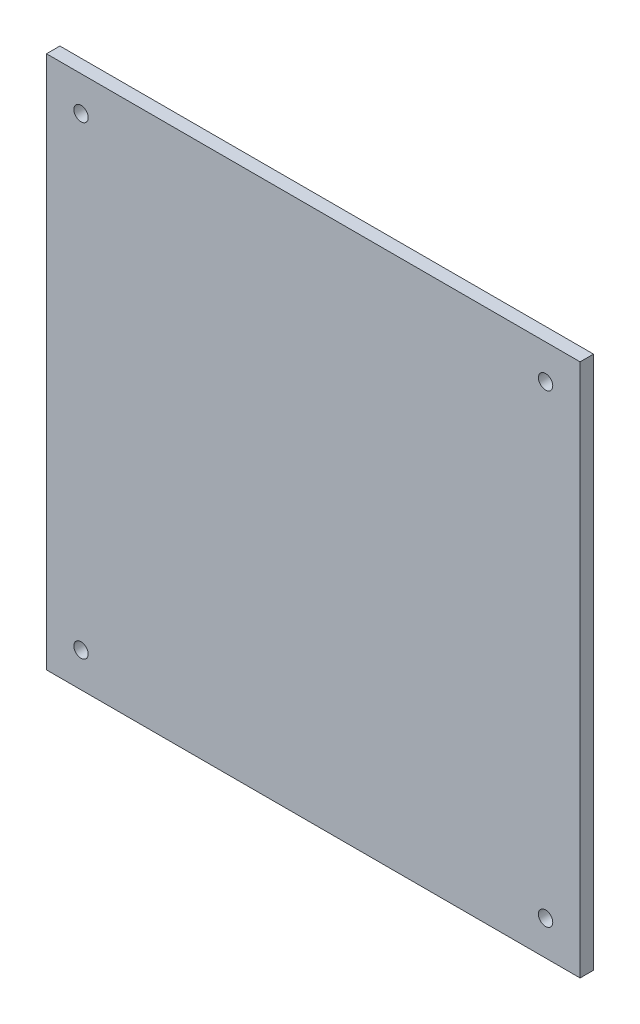
ISO-10303-21;
HEADER;
FILE_DESCRIPTION(('STEP AP214'),'2;1');
FILE_NAME('part.step','',(''),(''),'','','');
FILE_SCHEMA(('AUTOMOTIVE_DESIGN { 1 0 10303 214 1 1 1 1 }'));
ENDSEC;
DATA;
#1=APPLICATION_CONTEXT('core data for automotive mechanical design processes');
#2=APPLICATION_PROTOCOL_DEFINITION('international standard','automotive_design',2000,#1);
#3=PRODUCT_CONTEXT('',#1,'mechanical');
#4=PRODUCT('Part','Part','',(#3));
#5=PRODUCT_RELATED_PRODUCT_CATEGORY('part','',(#4));
#6=PRODUCT_DEFINITION_FORMATION('','',#4);
#7=PRODUCT_DEFINITION_CONTEXT('part definition',#1,'design');
#8=PRODUCT_DEFINITION('design','',#6,#7);
#9=PRODUCT_DEFINITION_SHAPE('','',#8);
#10=(LENGTH_UNIT() NAMED_UNIT(*) SI_UNIT(.MILLI.,.METRE.));
#11=(NAMED_UNIT(*) PLANE_ANGLE_UNIT() SI_UNIT($,.RADIAN.));
#12=(NAMED_UNIT(*) SI_UNIT($,.STERADIAN.) SOLID_ANGLE_UNIT());
#13=UNCERTAINTY_MEASURE_WITH_UNIT(LENGTH_MEASURE(1.E-05),#10,'distance_accuracy_value','');
#14=(GEOMETRIC_REPRESENTATION_CONTEXT(3) GLOBAL_UNCERTAINTY_ASSIGNED_CONTEXT((#13)) GLOBAL_UNIT_ASSIGNED_CONTEXT((#10,
#11,#12)) REPRESENTATION_CONTEXT('',''));
#15=CARTESIAN_POINT('',(0.,0.,0.));
#16=DIRECTION('',(0.,0.,1.));
#17=DIRECTION('',(1.,0.,0.));
#18=AXIS2_PLACEMENT_3D('',#15,#16,#17);
#19=CARTESIAN_POINT('',(-63.175,-63.175,3.175));
#20=DIRECTION('',(-1.,0.,0.));
#21=DIRECTION('',(0.,0.,1.));
#22=AXIS2_PLACEMENT_3D('',#19,#20,#21);
#23=PLANE('',#22);
#24=DIRECTION('',(0.,1.,0.));
#25=VECTOR('',#24,1.);
#26=CARTESIAN_POINT('',(-63.175,-63.175,0.));
#27=LINE('',#26,#25);
#28=CARTESIAN_POINT('',(-63.175,-63.175,0.));
#29=VERTEX_POINT('',#28);
#30=CARTESIAN_POINT('',(-63.175,63.175,0.));
#31=VERTEX_POINT('',#30);
#32=EDGE_CURVE('E99',#29,#31,#27,.T.);
#33=ORIENTED_EDGE('',*,*,#32,.F.);
#34=DIRECTION('',(0.,0.,-1.));
#35=VECTOR('',#34,1.);
#36=CARTESIAN_POINT('',(-63.175,-63.175,3.175));
#37=LINE('',#36,#35);
#38=CARTESIAN_POINT('',(-63.175,-63.175,3.175));
#39=VERTEX_POINT('',#38);
#40=EDGE_CURVE('E11',#39,#29,#37,.T.);
#41=ORIENTED_EDGE('',*,*,#40,.F.);
#42=DIRECTION('',(0.,1.,0.));
#43=VECTOR('',#42,1.);
#44=CARTESIAN_POINT('',(-63.175,-63.175,3.175));
#45=LINE('',#44,#43);
#46=CARTESIAN_POINT('',(-63.175,63.175,3.175));
#47=VERTEX_POINT('',#46);
#48=EDGE_CURVE('E93',#39,#47,#45,.T.);
#49=ORIENTED_EDGE('',*,*,#48,.T.);
#50=DIRECTION('',(0.,0.,-1.));
#51=VECTOR('',#50,1.);
#52=CARTESIAN_POINT('',(-63.175,63.175,3.175));
#53=LINE('',#52,#51);
#54=EDGE_CURVE('E36',#47,#31,#53,.T.);
#55=ORIENTED_EDGE('',*,*,#54,.T.);
#56=EDGE_LOOP('',(#33,#41,#49,#55));
#57=FACE_BOUND('',#56,.T.);
#58=ADVANCED_FACE('F33',(#57),#23,.T.);
#59=CARTESIAN_POINT('',(-63.175,-63.175,3.175));
#60=DIRECTION('',(0.,1.,0.));
#61=DIRECTION('',(0.,0.,1.));
#62=AXIS2_PLACEMENT_3D('',#59,#60,#61);
#63=PLANE('',#62);
#64=DIRECTION('',(1.,0.,0.));
#65=VECTOR('',#64,1.);
#66=CARTESIAN_POINT('',(-63.175,-63.175,0.));
#67=LINE('',#66,#65);
#68=CARTESIAN_POINT('',(63.175,-63.175,0.));
#69=VERTEX_POINT('',#68);
#70=EDGE_CURVE('E66',#29,#69,#67,.T.);
#71=ORIENTED_EDGE('',*,*,#70,.T.);
#72=DIRECTION('',(0.,0.,-1.));
#73=VECTOR('',#72,1.);
#74=CARTESIAN_POINT('',(63.175,-63.175,3.175));
#75=LINE('',#74,#73);
#76=CARTESIAN_POINT('',(63.175,-63.175,3.175));
#77=VERTEX_POINT('',#76);
#78=EDGE_CURVE('E42',#77,#69,#75,.T.);
#79=ORIENTED_EDGE('',*,*,#78,.F.);
#80=DIRECTION('',(1.,0.,0.));
#81=VECTOR('',#80,1.);
#82=CARTESIAN_POINT('',(-63.175,-63.175,3.175));
#83=LINE('',#82,#81);
#84=EDGE_CURVE('E83',#39,#77,#83,.T.);
#85=ORIENTED_EDGE('',*,*,#84,.F.);
#86=ORIENTED_EDGE('',*,*,#40,.T.);
#87=EDGE_LOOP('',(#71,#79,#85,#86));
#88=FACE_BOUND('',#87,.T.);
#89=ADVANCED_FACE('F110',(#88),#63,.F.);
#90=CARTESIAN_POINT('',(63.175,-63.175,3.175));
#91=DIRECTION('',(-1.,0.,0.));
#92=DIRECTION('',(0.,0.,1.));
#93=AXIS2_PLACEMENT_3D('',#90,#91,#92);
#94=PLANE('',#93);
#95=DIRECTION('',(0.,1.,0.));
#96=VECTOR('',#95,1.);
#97=CARTESIAN_POINT('',(63.175,-63.175,0.));
#98=LINE('',#97,#96);
#99=CARTESIAN_POINT('',(63.175,63.175,0.));
#100=VERTEX_POINT('',#99);
#101=EDGE_CURVE('E90',#69,#100,#98,.T.);
#102=ORIENTED_EDGE('',*,*,#101,.T.);
#103=DIRECTION('',(0.,0.,-1.));
#104=VECTOR('',#103,1.);
#105=CARTESIAN_POINT('',(63.175,63.175,3.175));
#106=LINE('',#105,#104);
#107=CARTESIAN_POINT('',(63.175,63.175,3.175));
#108=VERTEX_POINT('',#107);
#109=EDGE_CURVE('E87',#108,#100,#106,.T.);
#110=ORIENTED_EDGE('',*,*,#109,.F.);
#111=DIRECTION('',(0.,1.,0.));
#112=VECTOR('',#111,1.);
#113=CARTESIAN_POINT('',(63.175,-63.175,3.175));
#114=LINE('',#113,#112);
#115=EDGE_CURVE('E78',#77,#108,#114,.T.);
#116=ORIENTED_EDGE('',*,*,#115,.F.);
#117=ORIENTED_EDGE('',*,*,#78,.T.);
#118=EDGE_LOOP('',(#102,#110,#116,#117));
#119=FACE_BOUND('',#118,.T.);
#120=ADVANCED_FACE('F88',(#119),#94,.F.);
#121=CARTESIAN_POINT('',(-63.175,63.175,3.175));
#122=DIRECTION('',(0.,1.,0.));
#123=DIRECTION('',(0.,0.,1.));
#124=AXIS2_PLACEMENT_3D('',#121,#122,#123);
#125=PLANE('',#124);
#126=DIRECTION('',(1.,0.,0.));
#127=VECTOR('',#126,1.);
#128=CARTESIAN_POINT('',(-63.175,63.175,0.));
#129=LINE('',#128,#127);
#130=EDGE_CURVE('E102',#31,#100,#129,.T.);
#131=ORIENTED_EDGE('',*,*,#130,.F.);
#132=ORIENTED_EDGE('',*,*,#54,.F.);
#133=DIRECTION('',(1.,0.,0.));
#134=VECTOR('',#133,1.);
#135=CARTESIAN_POINT('',(-63.175,63.175,3.175));
#136=LINE('',#135,#134);
#137=EDGE_CURVE('E82',#47,#108,#136,.T.);
#138=ORIENTED_EDGE('',*,*,#137,.T.);
#139=ORIENTED_EDGE('',*,*,#109,.T.);
#140=EDGE_LOOP('',(#131,#132,#138,#139));
#141=FACE_BOUND('',#140,.T.);
#142=ADVANCED_FACE('F92',(#141),#125,.T.);
#143=CARTESIAN_POINT('',(0.,0.,3.175));
#144=DIRECTION('',(0.,0.,-1.));
#145=DIRECTION('',(-1.,0.,0.));
#146=AXIS2_PLACEMENT_3D('',#143,#144,#145);
#147=PLANE('',#146);
#148=CARTESIAN_POINT('',(55.0000000000009,54.9999999999987,3.17500000000001));
#149=DIRECTION('',(0.,0.,1.));
#150=DIRECTION('',(1.,0.,0.));
#151=AXIS2_PLACEMENT_3D('',#148,#149,#150);
#152=CIRCLE('',#151,1.7);
#153=CARTESIAN_POINT('',(56.7000000000009,54.9999999999987,3.17500000000001));
#154=VERTEX_POINT('',#153);
#155=EDGE_CURVE('E171',#154,#154,#152,.T.);
#156=ORIENTED_EDGE('',*,*,#155,.F.);
#157=EDGE_LOOP('',(#156));
#158=FACE_BOUND('',#157,.T.);
#159=CARTESIAN_POINT('',(55.0000000000001,-55.0000000000012,3.17500000000001));
#160=DIRECTION('',(0.,0.,1.));
#161=DIRECTION('',(1.,0.,0.));
#162=AXIS2_PLACEMENT_3D('',#159,#160,#161);
#163=CIRCLE('',#162,1.7);
#164=CARTESIAN_POINT('',(56.7000000000001,-55.0000000000012,3.17500000000001));
#165=VERTEX_POINT('',#164);
#166=EDGE_CURVE('E163',#165,#165,#163,.T.);
#167=ORIENTED_EDGE('',*,*,#166,.F.);
#168=EDGE_LOOP('',(#167));
#169=FACE_BOUND('',#168,.T.);
#170=CARTESIAN_POINT('',(-55.,-55.0000000000005,3.17500000000001));
#171=DIRECTION('',(0.,0.,1.));
#172=DIRECTION('',(1.,0.,0.));
#173=AXIS2_PLACEMENT_3D('',#170,#171,#172);
#174=CIRCLE('',#173,1.7);
#175=CARTESIAN_POINT('',(-53.3,-55.0000000000005,3.17500000000001));
#176=VERTEX_POINT('',#175);
#177=EDGE_CURVE('E156',#176,#176,#174,.T.);
#178=ORIENTED_EDGE('',*,*,#177,.F.);
#179=EDGE_LOOP('',(#178));
#180=FACE_BOUND('',#179,.T.);
#181=CARTESIAN_POINT('',(-54.9999999999992,54.9999999999995,3.17500000000001));
#182=DIRECTION('',(0.,0.,1.));
#183=DIRECTION('',(1.,0.,0.));
#184=AXIS2_PLACEMENT_3D('',#181,#182,#183);
#185=CIRCLE('',#184,1.7);
#186=CARTESIAN_POINT('',(-53.2999999999992,54.9999999999995,3.17500000000001));
#187=VERTEX_POINT('',#186);
#188=EDGE_CURVE('E160',#187,#187,#185,.T.);
#189=ORIENTED_EDGE('',*,*,#188,.F.);
#190=EDGE_LOOP('',(#189));
#191=FACE_BOUND('',#190,.T.);
#192=ORIENTED_EDGE('',*,*,#48,.F.);
#193=ORIENTED_EDGE('',*,*,#84,.T.);
#194=ORIENTED_EDGE('',*,*,#115,.T.);
#195=ORIENTED_EDGE('',*,*,#137,.F.);
#196=EDGE_LOOP('',(#192,#193,#194,#195));
#197=FACE_BOUND('',#196,.T.);
#198=ADVANCED_FACE('F81',(#158,#169,#180,#191,#197),#147,.F.);
#199=CARTESIAN_POINT('',(0.,0.,0.));
#200=DIRECTION('',(0.,0.,-1.));
#201=DIRECTION('',(-1.,0.,0.));
#202=AXIS2_PLACEMENT_3D('',#199,#200,#201);
#203=PLANE('',#202);
#204=CARTESIAN_POINT('',(55.0000000000009,54.9999999999987,0.));
#205=DIRECTION('',(0.,0.,1.));
#206=DIRECTION('',(1.,0.,0.));
#207=AXIS2_PLACEMENT_3D('',#204,#205,#206);
#208=CIRCLE('',#207,1.7);
#209=CARTESIAN_POINT('',(56.7000000000009,54.9999999999987,0.));
#210=VERTEX_POINT('',#209);
#211=EDGE_CURVE('E168',#210,#210,#208,.T.);
#212=ORIENTED_EDGE('',*,*,#211,.T.);
#213=EDGE_LOOP('',(#212));
#214=FACE_BOUND('',#213,.T.);
#215=CARTESIAN_POINT('',(55.0000000000001,-55.0000000000012,0.));
#216=DIRECTION('',(0.,0.,1.));
#217=DIRECTION('',(1.,0.,0.));
#218=AXIS2_PLACEMENT_3D('',#215,#216,#217);
#219=CIRCLE('',#218,1.7);
#220=CARTESIAN_POINT('',(56.7000000000001,-55.0000000000012,0.));
#221=VERTEX_POINT('',#220);
#222=EDGE_CURVE('E158',#221,#221,#219,.T.);
#223=ORIENTED_EDGE('',*,*,#222,.T.);
#224=EDGE_LOOP('',(#223));
#225=FACE_BOUND('',#224,.T.);
#226=CARTESIAN_POINT('',(-55.,-55.0000000000005,0.));
#227=DIRECTION('',(0.,0.,1.));
#228=DIRECTION('',(1.,0.,0.));
#229=AXIS2_PLACEMENT_3D('',#226,#227,#228);
#230=CIRCLE('',#229,1.7);
#231=CARTESIAN_POINT('',(-53.3,-55.0000000000005,0.));
#232=VERTEX_POINT('',#231);
#233=EDGE_CURVE('E153',#232,#232,#230,.T.);
#234=ORIENTED_EDGE('',*,*,#233,.T.);
#235=EDGE_LOOP('',(#234));
#236=FACE_BOUND('',#235,.T.);
#237=CARTESIAN_POINT('',(-54.9999999999992,54.9999999999995,0.));
#238=DIRECTION('',(0.,0.,1.));
#239=DIRECTION('',(1.,0.,0.));
#240=AXIS2_PLACEMENT_3D('',#237,#238,#239);
#241=CIRCLE('',#240,1.7);
#242=CARTESIAN_POINT('',(-53.2999999999992,54.9999999999995,0.));
#243=VERTEX_POINT('',#242);
#244=EDGE_CURVE('E103',#243,#243,#241,.T.);
#245=ORIENTED_EDGE('',*,*,#244,.T.);
#246=EDGE_LOOP('',(#245));
#247=FACE_BOUND('',#246,.T.);
#248=ORIENTED_EDGE('',*,*,#32,.T.);
#249=ORIENTED_EDGE('',*,*,#130,.T.);
#250=ORIENTED_EDGE('',*,*,#101,.F.);
#251=ORIENTED_EDGE('',*,*,#70,.F.);
#252=EDGE_LOOP('',(#248,#249,#250,#251));
#253=FACE_BOUND('',#252,.T.);
#254=ADVANCED_FACE('F108',(#214,#225,#236,#247,#253),#203,.T.);
#255=CARTESIAN_POINT('',(-54.9999999999992,54.9999999999995,0.));
#256=DIRECTION('',(0.,0.,1.));
#257=DIRECTION('',(1.,0.,0.));
#258=AXIS2_PLACEMENT_3D('',#255,#256,#257);
#259=CYLINDRICAL_SURFACE('',#258,1.7);
#260=ORIENTED_EDGE('',*,*,#244,.F.);
#261=EDGE_LOOP('',(#260));
#262=FACE_BOUND('',#261,.T.);
#263=ORIENTED_EDGE('',*,*,#188,.T.);
#264=EDGE_LOOP('',(#263));
#265=FACE_BOUND('',#264,.T.);
#266=ADVANCED_FACE('F129',(#262,#265),#259,.F.);
#267=CARTESIAN_POINT('',(-55.,-55.0000000000005,0.));
#268=DIRECTION('',(0.,0.,1.));
#269=DIRECTION('',(1.,0.,0.));
#270=AXIS2_PLACEMENT_3D('',#267,#268,#269);
#271=CYLINDRICAL_SURFACE('',#270,1.7);
#272=ORIENTED_EDGE('',*,*,#233,.F.);
#273=EDGE_LOOP('',(#272));
#274=FACE_BOUND('',#273,.T.);
#275=ORIENTED_EDGE('',*,*,#177,.T.);
#276=EDGE_LOOP('',(#275));
#277=FACE_BOUND('',#276,.T.);
#278=ADVANCED_FACE('F136',(#274,#277),#271,.F.);
#279=CARTESIAN_POINT('',(55.0000000000001,-55.0000000000012,0.));
#280=DIRECTION('',(0.,0.,1.));
#281=DIRECTION('',(1.,0.,0.));
#282=AXIS2_PLACEMENT_3D('',#279,#280,#281);
#283=CYLINDRICAL_SURFACE('',#282,1.7);
#284=ORIENTED_EDGE('',*,*,#222,.F.);
#285=EDGE_LOOP('',(#284));
#286=FACE_BOUND('',#285,.T.);
#287=ORIENTED_EDGE('',*,*,#166,.T.);
#288=EDGE_LOOP('',(#287));
#289=FACE_BOUND('',#288,.T.);
#290=ADVANCED_FACE('F141',(#286,#289),#283,.F.);
#291=CARTESIAN_POINT('',(55.0000000000009,54.9999999999987,0.));
#292=DIRECTION('',(0.,0.,1.));
#293=DIRECTION('',(1.,0.,0.));
#294=AXIS2_PLACEMENT_3D('',#291,#292,#293);
#295=CYLINDRICAL_SURFACE('',#294,1.7);
#296=ORIENTED_EDGE('',*,*,#211,.F.);
#297=EDGE_LOOP('',(#296));
#298=FACE_BOUND('',#297,.T.);
#299=ORIENTED_EDGE('',*,*,#155,.T.);
#300=EDGE_LOOP('',(#299));
#301=FACE_BOUND('',#300,.T.);
#302=ADVANCED_FACE('F138',(#298,#301),#295,.F.);
#303=CLOSED_SHELL('',(#58,#89,#120,#142,#198,#254,#266,#278,#290,#302));
#304=MANIFOLD_SOLID_BREP('B2',#303);
#305=ADVANCED_BREP_SHAPE_REPRESENTATION('',(#18,#304),#14);
#306=SHAPE_DEFINITION_REPRESENTATION(#9,#305);
ENDSEC;
END-ISO-10303-21;
